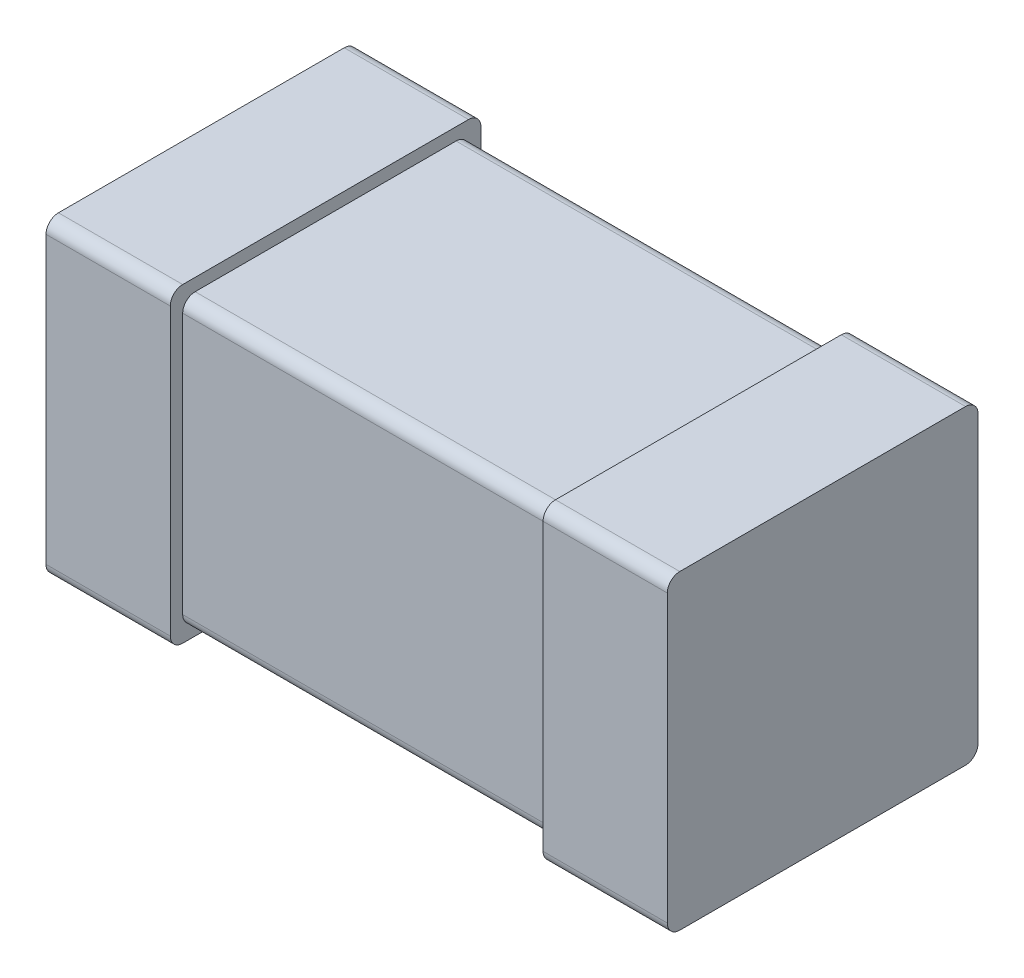
ISO-10303-21;
HEADER;
FILE_DESCRIPTION(('STEP AP214'),'2;1');
FILE_NAME('part.step','',(''),(''),'','','');
FILE_SCHEMA(('AUTOMOTIVE_DESIGN { 1 0 10303 214 1 1 1 1 }'));
ENDSEC;
DATA;
#1=APPLICATION_CONTEXT('core data for automotive mechanical design processes');
#2=APPLICATION_PROTOCOL_DEFINITION('international standard','automotive_design',2000,#1);
#3=PRODUCT_CONTEXT('',#1,'mechanical');
#4=PRODUCT('Part','Part','',(#3));
#5=PRODUCT_RELATED_PRODUCT_CATEGORY('part','',(#4));
#6=PRODUCT_DEFINITION_FORMATION('','',#4);
#7=PRODUCT_DEFINITION_CONTEXT('part definition',#1,'design');
#8=PRODUCT_DEFINITION('design','',#6,#7);
#9=PRODUCT_DEFINITION_SHAPE('','',#8);
#10=(LENGTH_UNIT() NAMED_UNIT(*) SI_UNIT(.MILLI.,.METRE.));
#11=(NAMED_UNIT(*) PLANE_ANGLE_UNIT() SI_UNIT($,.RADIAN.));
#12=(NAMED_UNIT(*) SI_UNIT($,.STERADIAN.) SOLID_ANGLE_UNIT());
#13=UNCERTAINTY_MEASURE_WITH_UNIT(LENGTH_MEASURE(1.E-05),#10,'distance_accuracy_value','');
#14=(GEOMETRIC_REPRESENTATION_CONTEXT(3) GLOBAL_UNCERTAINTY_ASSIGNED_CONTEXT((#13)) GLOBAL_UNIT_ASSIGNED_CONTEXT((#10,
#11,#12)) REPRESENTATION_CONTEXT('',''));
#15=CARTESIAN_POINT('',(0.,0.,0.));
#16=DIRECTION('',(0.,0.,1.));
#17=DIRECTION('',(1.,0.,0.));
#18=AXIS2_PLACEMENT_3D('',#15,#16,#17);
#19=CARTESIAN_POINT('',(0.5,-0.25,0.));
#20=DIRECTION('',(1.,0.,0.));
#21=DIRECTION('',(0.,1.,0.));
#22=AXIS2_PLACEMENT_3D('',#19,#20,#21);
#23=PLANE('',#22);
#24=DIRECTION('',(0.,0.,1.));
#25=VECTOR('',#24,1.);
#26=CARTESIAN_POINT('',(0.5,-0.25,0.));
#27=LINE('',#26,#25);
#28=CARTESIAN_POINT('',(0.5,-0.25,0.02));
#29=VERTEX_POINT('',#28);
#30=CARTESIAN_POINT('',(0.5,-0.25,0.48));
#31=VERTEX_POINT('',#30);
#32=EDGE_CURVE('E246',#29,#31,#27,.T.);
#33=ORIENTED_EDGE('',*,*,#32,.F.);
#34=CARTESIAN_POINT('',(0.5,-0.23,0.02));
#35=DIRECTION('',(1.,0.,0.));
#36=DIRECTION('',(0.,0.,1.));
#37=AXIS2_PLACEMENT_3D('',#34,#35,#36);
#38=CIRCLE('',#37,0.02);
#39=CARTESIAN_POINT('',(0.5,-0.23,0.));
#40=VERTEX_POINT('',#39);
#41=EDGE_CURVE('E237',#29,#40,#38,.T.);
#42=ORIENTED_EDGE('',*,*,#41,.T.);
#43=DIRECTION('',(0.,1.,0.));
#44=VECTOR('',#43,1.);
#45=CARTESIAN_POINT('',(0.5,-0.25,0.));
#46=LINE('',#45,#44);
#47=CARTESIAN_POINT('',(0.5,0.23,0.));
#48=VERTEX_POINT('',#47);
#49=EDGE_CURVE('E224',#40,#48,#46,.T.);
#50=ORIENTED_EDGE('',*,*,#49,.T.);
#51=CARTESIAN_POINT('',(0.5,0.23,0.02));
#52=DIRECTION('',(-1.,0.,0.));
#53=DIRECTION('',(0.,0.,1.));
#54=AXIS2_PLACEMENT_3D('',#51,#52,#53);
#55=CIRCLE('',#54,0.02);
#56=CARTESIAN_POINT('',(0.5,0.25,0.02));
#57=VERTEX_POINT('',#56);
#58=EDGE_CURVE('E21',#57,#48,#55,.T.);
#59=ORIENTED_EDGE('',*,*,#58,.F.);
#60=DIRECTION('',(0.,0.,1.));
#61=VECTOR('',#60,1.);
#62=CARTESIAN_POINT('',(0.5,0.25,0.));
#63=LINE('',#62,#61);
#64=CARTESIAN_POINT('',(0.5,0.25,0.48));
#65=VERTEX_POINT('',#64);
#66=EDGE_CURVE('E11',#57,#65,#63,.T.);
#67=ORIENTED_EDGE('',*,*,#66,.T.);
#68=CARTESIAN_POINT('',(0.5,0.23,0.48));
#69=DIRECTION('',(1.,0.,0.));
#70=DIRECTION('',(0.,0.,1.));
#71=AXIS2_PLACEMENT_3D('',#68,#69,#70);
#72=CIRCLE('',#71,0.02);
#73=CARTESIAN_POINT('',(0.5,0.23,0.5));
#74=VERTEX_POINT('',#73);
#75=EDGE_CURVE('E200',#65,#74,#72,.T.);
#76=ORIENTED_EDGE('',*,*,#75,.T.);
#77=DIRECTION('',(0.,1.,0.));
#78=VECTOR('',#77,1.);
#79=CARTESIAN_POINT('',(0.5,-0.25,0.5));
#80=LINE('',#79,#78);
#81=CARTESIAN_POINT('',(0.5,-0.23,0.5));
#82=VERTEX_POINT('',#81);
#83=EDGE_CURVE('E204',#82,#74,#80,.T.);
#84=ORIENTED_EDGE('',*,*,#83,.F.);
#85=CARTESIAN_POINT('',(0.5,-0.23,0.48));
#86=DIRECTION('',(-1.,0.,0.));
#87=DIRECTION('',(0.,0.,1.));
#88=AXIS2_PLACEMENT_3D('',#85,#86,#87);
#89=CIRCLE('',#88,0.02);
#90=EDGE_CURVE('E235',#31,#82,#89,.T.);
#91=ORIENTED_EDGE('',*,*,#90,.F.);
#92=EDGE_LOOP('',(#33,#42,#50,#59,#67,#76,#84,#91));
#93=FACE_BOUND('',#92,.T.);
#94=ADVANCED_FACE('F17',(#93),#23,.T.);
#95=CARTESIAN_POINT('',(0.3,0.25,0.));
#96=DIRECTION('',(0.,1.,0.));
#97=DIRECTION('',(1.,0.,0.));
#98=AXIS2_PLACEMENT_3D('',#95,#96,#97);
#99=PLANE('',#98);
#100=ORIENTED_EDGE('',*,*,#66,.F.);
#101=DIRECTION('',(1.,0.,0.));
#102=VECTOR('',#101,1.);
#103=CARTESIAN_POINT('',(0.3,0.25,0.02));
#104=LINE('',#103,#102);
#105=CARTESIAN_POINT('',(0.3,0.25,0.02));
#106=VERTEX_POINT('',#105);
#107=EDGE_CURVE('E219',#106,#57,#104,.T.);
#108=ORIENTED_EDGE('',*,*,#107,.F.);
#109=DIRECTION('',(0.,0.,1.));
#110=VECTOR('',#109,1.);
#111=CARTESIAN_POINT('',(0.3,0.25,0.));
#112=LINE('',#111,#110);
#113=CARTESIAN_POINT('',(0.3,0.25,0.48));
#114=VERTEX_POINT('',#113);
#115=EDGE_CURVE('E265',#106,#114,#112,.T.);
#116=ORIENTED_EDGE('',*,*,#115,.T.);
#117=DIRECTION('',(1.,0.,0.));
#118=VECTOR('',#117,1.);
#119=CARTESIAN_POINT('',(0.3,0.25,0.48));
#120=LINE('',#119,#118);
#121=EDGE_CURVE('E28',#114,#65,#120,.T.);
#122=ORIENTED_EDGE('',*,*,#121,.T.);
#123=EDGE_LOOP('',(#100,#108,#116,#122));
#124=FACE_BOUND('',#123,.T.);
#125=ADVANCED_FACE('F19',(#124),#99,.T.);
#126=CARTESIAN_POINT('',(0.3,0.23,0.48));
#127=DIRECTION('',(1.,0.,0.));
#128=DIRECTION('',(0.,1.,0.));
#129=AXIS2_PLACEMENT_3D('',#126,#127,#128);
#130=CYLINDRICAL_SURFACE('',#129,0.02);
#131=CARTESIAN_POINT('',(0.3,0.23,0.48));
#132=DIRECTION('',(1.,0.,0.));
#133=DIRECTION('',(0.,0.,1.));
#134=AXIS2_PLACEMENT_3D('',#131,#132,#133);
#135=CIRCLE('',#134,0.02);
#136=CARTESIAN_POINT('',(0.3,0.23,0.5));
#137=VERTEX_POINT('',#136);
#138=EDGE_CURVE('E214',#114,#137,#135,.T.);
#139=ORIENTED_EDGE('',*,*,#138,.T.);
#140=DIRECTION('',(1.,0.,0.));
#141=VECTOR('',#140,1.);
#142=CARTESIAN_POINT('',(0.3,0.23,0.5));
#143=LINE('',#142,#141);
#144=EDGE_CURVE('E211',#137,#74,#143,.T.);
#145=ORIENTED_EDGE('',*,*,#144,.T.);
#146=ORIENTED_EDGE('',*,*,#75,.F.);
#147=ORIENTED_EDGE('',*,*,#121,.F.);
#148=EDGE_LOOP('',(#139,#145,#146,#147));
#149=FACE_BOUND('',#148,.T.);
#150=ADVANCED_FACE('F212',(#149),#130,.T.);
#151=CARTESIAN_POINT('',(0.3,0.23,0.02));
#152=DIRECTION('',(1.,0.,0.));
#153=DIRECTION('',(0.,1.,0.));
#154=AXIS2_PLACEMENT_3D('',#151,#152,#153);
#155=CYLINDRICAL_SURFACE('',#154,0.02);
#156=ORIENTED_EDGE('',*,*,#107,.T.);
#157=ORIENTED_EDGE('',*,*,#58,.T.);
#158=DIRECTION('',(1.,0.,0.));
#159=VECTOR('',#158,1.);
#160=CARTESIAN_POINT('',(0.3,0.23,0.));
#161=LINE('',#160,#159);
#162=CARTESIAN_POINT('',(0.3,0.23,0.));
#163=VERTEX_POINT('',#162);
#164=EDGE_CURVE('E229',#163,#48,#161,.T.);
#165=ORIENTED_EDGE('',*,*,#164,.F.);
#166=CARTESIAN_POINT('',(0.3,0.23,0.02));
#167=DIRECTION('',(-1.,0.,0.));
#168=DIRECTION('',(0.,0.,1.));
#169=AXIS2_PLACEMENT_3D('',#166,#167,#168);
#170=CIRCLE('',#169,0.02);
#171=EDGE_CURVE('E260',#106,#163,#170,.T.);
#172=ORIENTED_EDGE('',*,*,#171,.F.);
#173=EDGE_LOOP('',(#156,#157,#165,#172));
#174=FACE_BOUND('',#173,.T.);
#175=ADVANCED_FACE('F586',(#174),#155,.T.);
#176=CARTESIAN_POINT('',(0.3,-0.25,0.5));
#177=DIRECTION('',(0.,0.,1.));
#178=DIRECTION('',(1.,0.,0.));
#179=AXIS2_PLACEMENT_3D('',#176,#177,#178);
#180=PLANE('',#179);
#181=DIRECTION('',(0.,1.,0.));
#182=VECTOR('',#181,1.);
#183=CARTESIAN_POINT('',(0.3,-0.25,0.5));
#184=LINE('',#183,#182);
#185=CARTESIAN_POINT('',(0.3,-0.23,0.5));
#186=VERTEX_POINT('',#185);
#187=EDGE_CURVE('E268',#186,#137,#184,.T.);
#188=ORIENTED_EDGE('',*,*,#187,.F.);
#189=DIRECTION('',(1.,0.,0.));
#190=VECTOR('',#189,1.);
#191=CARTESIAN_POINT('',(0.3,-0.23,0.5));
#192=LINE('',#191,#190);
#193=EDGE_CURVE('E221',#186,#82,#192,.T.);
#194=ORIENTED_EDGE('',*,*,#193,.T.);
#195=ORIENTED_EDGE('',*,*,#83,.T.);
#196=ORIENTED_EDGE('',*,*,#144,.F.);
#197=EDGE_LOOP('',(#188,#194,#195,#196));
#198=FACE_BOUND('',#197,.T.);
#199=ADVANCED_FACE('F220',(#198),#180,.T.);
#200=CARTESIAN_POINT('',(0.3,-0.25,0.));
#201=DIRECTION('',(0.,0.,1.));
#202=DIRECTION('',(1.,0.,0.));
#203=AXIS2_PLACEMENT_3D('',#200,#201,#202);
#204=PLANE('',#203);
#205=ORIENTED_EDGE('',*,*,#164,.T.);
#206=ORIENTED_EDGE('',*,*,#49,.F.);
#207=DIRECTION('',(1.,0.,0.));
#208=VECTOR('',#207,1.);
#209=CARTESIAN_POINT('',(0.3,-0.23,0.));
#210=LINE('',#209,#208);
#211=CARTESIAN_POINT('',(0.3,-0.23,0.));
#212=VERTEX_POINT('',#211);
#213=EDGE_CURVE('E242',#212,#40,#210,.T.);
#214=ORIENTED_EDGE('',*,*,#213,.F.);
#215=DIRECTION('',(0.,1.,0.));
#216=VECTOR('',#215,1.);
#217=CARTESIAN_POINT('',(0.3,-0.25,0.));
#218=LINE('',#217,#216);
#219=EDGE_CURVE('E264',#212,#163,#218,.T.);
#220=ORIENTED_EDGE('',*,*,#219,.T.);
#221=EDGE_LOOP('',(#205,#206,#214,#220));
#222=FACE_BOUND('',#221,.T.);
#223=ADVANCED_FACE('F537',(#222),#204,.F.);
#224=CARTESIAN_POINT('',(0.3,-0.23,0.48));
#225=DIRECTION('',(1.,0.,0.));
#226=DIRECTION('',(0.,-1.,0.));
#227=AXIS2_PLACEMENT_3D('',#224,#225,#226);
#228=CYLINDRICAL_SURFACE('',#227,0.02);
#229=DIRECTION('',(1.,0.,0.));
#230=VECTOR('',#229,1.);
#231=CARTESIAN_POINT('',(0.3,-0.25,0.48));
#232=LINE('',#231,#230);
#233=CARTESIAN_POINT('',(0.3,-0.25,0.48));
#234=VERTEX_POINT('',#233);
#235=EDGE_CURVE('E251',#234,#31,#232,.T.);
#236=ORIENTED_EDGE('',*,*,#235,.T.);
#237=ORIENTED_EDGE('',*,*,#90,.T.);
#238=ORIENTED_EDGE('',*,*,#193,.F.);
#239=CARTESIAN_POINT('',(0.3,-0.23,0.48));
#240=DIRECTION('',(-1.,0.,0.));
#241=DIRECTION('',(0.,0.,1.));
#242=AXIS2_PLACEMENT_3D('',#239,#240,#241);
#243=CIRCLE('',#242,0.02);
#244=EDGE_CURVE('E269',#234,#186,#243,.T.);
#245=ORIENTED_EDGE('',*,*,#244,.F.);
#246=EDGE_LOOP('',(#236,#237,#238,#245));
#247=FACE_BOUND('',#246,.T.);
#248=ADVANCED_FACE('F533',(#247),#228,.T.);
#249=CARTESIAN_POINT('',(0.3,-0.23,0.02));
#250=DIRECTION('',(1.,0.,0.));
#251=DIRECTION('',(0.,-1.,0.));
#252=AXIS2_PLACEMENT_3D('',#249,#250,#251);
#253=CYLINDRICAL_SURFACE('',#252,0.02);
#254=CARTESIAN_POINT('',(0.3,-0.23,0.02));
#255=DIRECTION('',(1.,0.,0.));
#256=DIRECTION('',(0.,0.,1.));
#257=AXIS2_PLACEMENT_3D('',#254,#255,#256);
#258=CIRCLE('',#257,0.02);
#259=CARTESIAN_POINT('',(0.3,-0.25,0.02));
#260=VERTEX_POINT('',#259);
#261=EDGE_CURVE('E259',#260,#212,#258,.T.);
#262=ORIENTED_EDGE('',*,*,#261,.T.);
#263=ORIENTED_EDGE('',*,*,#213,.T.);
#264=ORIENTED_EDGE('',*,*,#41,.F.);
#265=DIRECTION('',(1.,0.,0.));
#266=VECTOR('',#265,1.);
#267=CARTESIAN_POINT('',(0.3,-0.25,0.02));
#268=LINE('',#267,#266);
#269=EDGE_CURVE('E250',#260,#29,#268,.T.);
#270=ORIENTED_EDGE('',*,*,#269,.F.);
#271=EDGE_LOOP('',(#262,#263,#264,#270));
#272=FACE_BOUND('',#271,.T.);
#273=ADVANCED_FACE('F536',(#272),#253,.T.);
#274=CARTESIAN_POINT('',(0.3,-0.25,0.));
#275=DIRECTION('',(0.,1.,0.));
#276=DIRECTION('',(1.,0.,0.));
#277=AXIS2_PLACEMENT_3D('',#274,#275,#276);
#278=PLANE('',#277);
#279=ORIENTED_EDGE('',*,*,#235,.F.);
#280=DIRECTION('',(0.,0.,1.));
#281=VECTOR('',#280,1.);
#282=CARTESIAN_POINT('',(0.3,-0.25,0.));
#283=LINE('',#282,#281);
#284=EDGE_CURVE('E255',#260,#234,#283,.T.);
#285=ORIENTED_EDGE('',*,*,#284,.F.);
#286=ORIENTED_EDGE('',*,*,#269,.T.);
#287=ORIENTED_EDGE('',*,*,#32,.T.);
#288=EDGE_LOOP('',(#279,#285,#286,#287));
#289=FACE_BOUND('',#288,.T.);
#290=ADVANCED_FACE('F521',(#289),#278,.F.);
#291=CARTESIAN_POINT('',(0.3,-0.25,0.));
#292=DIRECTION('',(1.,0.,0.));
#293=DIRECTION('',(0.,1.,0.));
#294=AXIS2_PLACEMENT_3D('',#291,#292,#293);
#295=PLANE('',#294);
#296=DIRECTION('',(0.,1.,0.));
#297=VECTOR('',#296,1.);
#298=CARTESIAN_POINT('',(0.3,-0.23,0.02));
#299=LINE('',#298,#297);
#300=CARTESIAN_POINT('',(0.3,-0.21,0.02));
#301=VERTEX_POINT('',#300);
#302=CARTESIAN_POINT('',(0.3,0.21,0.02));
#303=VERTEX_POINT('',#302);
#304=EDGE_CURVE('E311',#301,#303,#299,.T.);
#305=ORIENTED_EDGE('',*,*,#304,.T.);
#306=CARTESIAN_POINT('',(0.3,0.21,0.04));
#307=DIRECTION('',(-1.,0.,0.));
#308=DIRECTION('',(0.,0.,1.));
#309=AXIS2_PLACEMENT_3D('',#306,#307,#308);
#310=CIRCLE('',#309,0.02);
#311=CARTESIAN_POINT('',(0.3,0.23,0.04));
#312=VERTEX_POINT('',#311);
#313=EDGE_CURVE('E306',#312,#303,#310,.T.);
#314=ORIENTED_EDGE('',*,*,#313,.F.);
#315=DIRECTION('',(0.,0.,1.));
#316=VECTOR('',#315,1.);
#317=CARTESIAN_POINT('',(0.3,0.23,0.02));
#318=LINE('',#317,#316);
#319=CARTESIAN_POINT('',(0.3,0.23,0.46));
#320=VERTEX_POINT('',#319);
#321=EDGE_CURVE('E302',#312,#320,#318,.T.);
#322=ORIENTED_EDGE('',*,*,#321,.T.);
#323=CARTESIAN_POINT('',(0.3,0.21,0.46));
#324=DIRECTION('',(1.,0.,0.));
#325=DIRECTION('',(0.,0.,1.));
#326=AXIS2_PLACEMENT_3D('',#323,#324,#325);
#327=CIRCLE('',#326,0.02);
#328=CARTESIAN_POINT('',(0.3,0.21,0.48));
#329=VERTEX_POINT('',#328);
#330=EDGE_CURVE('E293',#320,#329,#327,.T.);
#331=ORIENTED_EDGE('',*,*,#330,.T.);
#332=DIRECTION('',(0.,1.,0.));
#333=VECTOR('',#332,1.);
#334=CARTESIAN_POINT('',(0.3,-0.23,0.48));
#335=LINE('',#334,#333);
#336=CARTESIAN_POINT('',(0.3,-0.21,0.48));
#337=VERTEX_POINT('',#336);
#338=EDGE_CURVE('E286',#337,#329,#335,.T.);
#339=ORIENTED_EDGE('',*,*,#338,.F.);
#340=CARTESIAN_POINT('',(0.3,-0.21,0.46));
#341=DIRECTION('',(-1.,0.,0.));
#342=DIRECTION('',(0.,0.,1.));
#343=AXIS2_PLACEMENT_3D('',#340,#341,#342);
#344=CIRCLE('',#343,0.02);
#345=CARTESIAN_POINT('',(0.3,-0.23,0.46));
#346=VERTEX_POINT('',#345);
#347=EDGE_CURVE('E276',#346,#337,#344,.T.);
#348=ORIENTED_EDGE('',*,*,#347,.F.);
#349=DIRECTION('',(0.,0.,1.));
#350=VECTOR('',#349,1.);
#351=CARTESIAN_POINT('',(0.3,-0.23,0.02));
#352=LINE('',#351,#350);
#353=CARTESIAN_POINT('',(0.3,-0.23,0.04));
#354=VERTEX_POINT('',#353);
#355=EDGE_CURVE('E273',#354,#346,#352,.T.);
#356=ORIENTED_EDGE('',*,*,#355,.F.);
#357=CARTESIAN_POINT('',(0.3,-0.21,0.04));
#358=DIRECTION('',(1.,0.,0.));
#359=DIRECTION('',(0.,0.,1.));
#360=AXIS2_PLACEMENT_3D('',#357,#358,#359);
#361=CIRCLE('',#360,0.02);
#362=EDGE_CURVE('E317',#354,#301,#361,.T.);
#363=ORIENTED_EDGE('',*,*,#362,.T.);
#364=EDGE_LOOP('',(#305,#314,#322,#331,#339,#348,#356,#363));
#365=FACE_BOUND('',#364,.T.);
#366=ORIENTED_EDGE('',*,*,#244,.T.);
#367=ORIENTED_EDGE('',*,*,#187,.T.);
#368=ORIENTED_EDGE('',*,*,#138,.F.);
#369=ORIENTED_EDGE('',*,*,#115,.F.);
#370=ORIENTED_EDGE('',*,*,#171,.T.);
#371=ORIENTED_EDGE('',*,*,#219,.F.);
#372=ORIENTED_EDGE('',*,*,#261,.F.);
#373=ORIENTED_EDGE('',*,*,#284,.T.);
#374=EDGE_LOOP('',(#366,#367,#368,#369,#370,#371,#372,#373));
#375=FACE_BOUND('',#374,.T.);
#376=ADVANCED_FACE('F481',(#365,#375),#295,.F.);
#377=CARTESIAN_POINT('',(-0.3,-0.23,0.02));
#378=DIRECTION('',(0.,1.,0.));
#379=DIRECTION('',(1.,0.,0.));
#380=AXIS2_PLACEMENT_3D('',#377,#378,#379);
#381=PLANE('',#380);
#382=DIRECTION('',(1.,0.,0.));
#383=VECTOR('',#382,1.);
#384=CARTESIAN_POINT('',(-0.3,-0.23,0.46));
#385=LINE('',#384,#383);
#386=CARTESIAN_POINT('',(-0.3,-0.23,0.46));
#387=VERTEX_POINT('',#386);
#388=EDGE_CURVE('E279',#387,#346,#385,.T.);
#389=ORIENTED_EDGE('',*,*,#388,.F.);
#390=DIRECTION('',(0.,0.,1.));
#391=VECTOR('',#390,1.);
#392=CARTESIAN_POINT('',(-0.3,-0.23,0.02));
#393=LINE('',#392,#391);
#394=CARTESIAN_POINT('',(-0.3,-0.23,0.04));
#395=VERTEX_POINT('',#394);
#396=EDGE_CURVE('E352',#395,#387,#393,.T.);
#397=ORIENTED_EDGE('',*,*,#396,.F.);
#398=DIRECTION('',(1.,0.,0.));
#399=VECTOR('',#398,1.);
#400=CARTESIAN_POINT('',(-0.3,-0.23,0.04));
#401=LINE('',#400,#399);
#402=EDGE_CURVE('E312',#395,#354,#401,.T.);
#403=ORIENTED_EDGE('',*,*,#402,.T.);
#404=ORIENTED_EDGE('',*,*,#355,.T.);
#405=EDGE_LOOP('',(#389,#397,#403,#404));
#406=FACE_BOUND('',#405,.T.);
#407=ADVANCED_FACE('F512',(#406),#381,.F.);
#408=CARTESIAN_POINT('',(-0.3,-0.21,0.46));
#409=DIRECTION('',(1.,0.,0.));
#410=DIRECTION('',(0.,-1.,0.));
#411=AXIS2_PLACEMENT_3D('',#408,#409,#410);
#412=CYLINDRICAL_SURFACE('',#411,0.02);
#413=ORIENTED_EDGE('',*,*,#388,.T.);
#414=ORIENTED_EDGE('',*,*,#347,.T.);
#415=DIRECTION('',(1.,0.,0.));
#416=VECTOR('',#415,1.);
#417=CARTESIAN_POINT('',(-0.3,-0.21,0.48));
#418=LINE('',#417,#416);
#419=CARTESIAN_POINT('',(-0.3,-0.21,0.48));
#420=VERTEX_POINT('',#419);
#421=EDGE_CURVE('E289',#420,#337,#418,.T.);
#422=ORIENTED_EDGE('',*,*,#421,.F.);
#423=CARTESIAN_POINT('',(-0.3,-0.21,0.46));
#424=DIRECTION('',(-1.,0.,0.));
#425=DIRECTION('',(0.,0.,1.));
#426=AXIS2_PLACEMENT_3D('',#423,#424,#425);
#427=CIRCLE('',#426,0.02);
#428=EDGE_CURVE('E348',#387,#420,#427,.T.);
#429=ORIENTED_EDGE('',*,*,#428,.F.);
#430=EDGE_LOOP('',(#413,#414,#422,#429));
#431=FACE_BOUND('',#430,.T.);
#432=ADVANCED_FACE('F509',(#431),#412,.T.);
#433=CARTESIAN_POINT('',(-0.3,-0.23,0.48));
#434=DIRECTION('',(0.,0.,1.));
#435=DIRECTION('',(1.,0.,0.));
#436=AXIS2_PLACEMENT_3D('',#433,#434,#435);
#437=PLANE('',#436);
#438=DIRECTION('',(0.,1.,0.));
#439=VECTOR('',#438,1.);
#440=CARTESIAN_POINT('',(-0.3,-0.23,0.48));
#441=LINE('',#440,#439);
#442=CARTESIAN_POINT('',(-0.3,0.21,0.48));
#443=VERTEX_POINT('',#442);
#444=EDGE_CURVE('E344',#420,#443,#441,.T.);
#445=ORIENTED_EDGE('',*,*,#444,.F.);
#446=ORIENTED_EDGE('',*,*,#421,.T.);
#447=ORIENTED_EDGE('',*,*,#338,.T.);
#448=DIRECTION('',(1.,0.,0.));
#449=VECTOR('',#448,1.);
#450=CARTESIAN_POINT('',(-0.3,0.21,0.48));
#451=LINE('',#450,#449);
#452=EDGE_CURVE('E294',#443,#329,#451,.T.);
#453=ORIENTED_EDGE('',*,*,#452,.F.);
#454=EDGE_LOOP('',(#445,#446,#447,#453));
#455=FACE_BOUND('',#454,.T.);
#456=ADVANCED_FACE('F506',(#455),#437,.T.);
#457=CARTESIAN_POINT('',(-0.3,0.21,0.46));
#458=DIRECTION('',(1.,0.,0.));
#459=DIRECTION('',(0.,1.,0.));
#460=AXIS2_PLACEMENT_3D('',#457,#458,#459);
#461=CYLINDRICAL_SURFACE('',#460,0.02);
#462=CARTESIAN_POINT('',(-0.3,0.21,0.46));
#463=DIRECTION('',(1.,0.,0.));
#464=DIRECTION('',(0.,0.,1.));
#465=AXIS2_PLACEMENT_3D('',#462,#463,#464);
#466=CIRCLE('',#465,0.02);
#467=CARTESIAN_POINT('',(-0.3,0.23,0.46));
#468=VERTEX_POINT('',#467);
#469=EDGE_CURVE('E340',#468,#443,#466,.T.);
#470=ORIENTED_EDGE('',*,*,#469,.T.);
#471=ORIENTED_EDGE('',*,*,#452,.T.);
#472=ORIENTED_EDGE('',*,*,#330,.F.);
#473=DIRECTION('',(1.,0.,0.));
#474=VECTOR('',#473,1.);
#475=CARTESIAN_POINT('',(-0.3,0.23,0.46));
#476=LINE('',#475,#474);
#477=EDGE_CURVE('E298',#468,#320,#476,.T.);
#478=ORIENTED_EDGE('',*,*,#477,.F.);
#479=EDGE_LOOP('',(#470,#471,#472,#478));
#480=FACE_BOUND('',#479,.T.);
#481=ADVANCED_FACE('F503',(#480),#461,.T.);
#482=CARTESIAN_POINT('',(-0.3,0.23,0.02));
#483=DIRECTION('',(0.,1.,0.));
#484=DIRECTION('',(1.,0.,0.));
#485=AXIS2_PLACEMENT_3D('',#482,#483,#484);
#486=PLANE('',#485);
#487=ORIENTED_EDGE('',*,*,#321,.F.);
#488=DIRECTION('',(1.,0.,0.));
#489=VECTOR('',#488,1.);
#490=CARTESIAN_POINT('',(-0.3,0.23,0.04));
#491=LINE('',#490,#489);
#492=CARTESIAN_POINT('',(-0.3,0.23,0.04));
#493=VERTEX_POINT('',#492);
#494=EDGE_CURVE('E307',#493,#312,#491,.T.);
#495=ORIENTED_EDGE('',*,*,#494,.F.);
#496=DIRECTION('',(0.,0.,1.));
#497=VECTOR('',#496,1.);
#498=CARTESIAN_POINT('',(-0.3,0.23,0.02));
#499=LINE('',#498,#497);
#500=EDGE_CURVE('E333',#493,#468,#499,.T.);
#501=ORIENTED_EDGE('',*,*,#500,.T.);
#502=ORIENTED_EDGE('',*,*,#477,.T.);
#503=EDGE_LOOP('',(#487,#495,#501,#502));
#504=FACE_BOUND('',#503,.T.);
#505=ADVANCED_FACE('F501',(#504),#486,.T.);
#506=CARTESIAN_POINT('',(-0.3,0.21,0.04));
#507=DIRECTION('',(1.,0.,0.));
#508=DIRECTION('',(0.,1.,0.));
#509=AXIS2_PLACEMENT_3D('',#506,#507,#508);
#510=CYLINDRICAL_SURFACE('',#509,0.02);
#511=ORIENTED_EDGE('',*,*,#494,.T.);
#512=ORIENTED_EDGE('',*,*,#313,.T.);
#513=DIRECTION('',(1.,0.,0.));
#514=VECTOR('',#513,1.);
#515=CARTESIAN_POINT('',(-0.3,0.21,0.02));
#516=LINE('',#515,#514);
#517=CARTESIAN_POINT('',(-0.3,0.21,0.02));
#518=VERTEX_POINT('',#517);
#519=EDGE_CURVE('E316',#518,#303,#516,.T.);
#520=ORIENTED_EDGE('',*,*,#519,.F.);
#521=CARTESIAN_POINT('',(-0.3,0.21,0.04));
#522=DIRECTION('',(-1.,0.,0.));
#523=DIRECTION('',(0.,0.,1.));
#524=AXIS2_PLACEMENT_3D('',#521,#522,#523);
#525=CIRCLE('',#524,0.02);
#526=EDGE_CURVE('E326',#493,#518,#525,.T.);
#527=ORIENTED_EDGE('',*,*,#526,.F.);
#528=EDGE_LOOP('',(#511,#512,#520,#527));
#529=FACE_BOUND('',#528,.T.);
#530=ADVANCED_FACE('F498',(#529),#510,.T.);
#531=CARTESIAN_POINT('',(-0.3,-0.23,0.02));
#532=DIRECTION('',(0.,0.,1.));
#533=DIRECTION('',(1.,0.,0.));
#534=AXIS2_PLACEMENT_3D('',#531,#532,#533);
#535=PLANE('',#534);
#536=ORIENTED_EDGE('',*,*,#519,.T.);
#537=ORIENTED_EDGE('',*,*,#304,.F.);
#538=DIRECTION('',(1.,0.,0.));
#539=VECTOR('',#538,1.);
#540=CARTESIAN_POINT('',(-0.3,-0.21,0.02));
#541=LINE('',#540,#539);
#542=CARTESIAN_POINT('',(-0.3,-0.21,0.02));
#543=VERTEX_POINT('',#542);
#544=EDGE_CURVE('E318',#543,#301,#541,.T.);
#545=ORIENTED_EDGE('',*,*,#544,.F.);
#546=DIRECTION('',(0.,1.,0.));
#547=VECTOR('',#546,1.);
#548=CARTESIAN_POINT('',(-0.3,-0.23,0.02));
#549=LINE('',#548,#547);
#550=EDGE_CURVE('E322',#543,#518,#549,.T.);
#551=ORIENTED_EDGE('',*,*,#550,.T.);
#552=EDGE_LOOP('',(#536,#537,#545,#551));
#553=FACE_BOUND('',#552,.T.);
#554=ADVANCED_FACE('F490',(#553),#535,.F.);
#555=CARTESIAN_POINT('',(-0.3,-0.21,0.04));
#556=DIRECTION('',(1.,0.,0.));
#557=DIRECTION('',(0.,-1.,0.));
#558=AXIS2_PLACEMENT_3D('',#555,#556,#557);
#559=CYLINDRICAL_SURFACE('',#558,0.02);
#560=CARTESIAN_POINT('',(-0.3,-0.21,0.04));
#561=DIRECTION('',(1.,0.,0.));
#562=DIRECTION('',(0.,0.,1.));
#563=AXIS2_PLACEMENT_3D('',#560,#561,#562);
#564=CIRCLE('',#563,0.02);
#565=EDGE_CURVE('E356',#395,#543,#564,.T.);
#566=ORIENTED_EDGE('',*,*,#565,.T.);
#567=ORIENTED_EDGE('',*,*,#544,.T.);
#568=ORIENTED_EDGE('',*,*,#362,.F.);
#569=ORIENTED_EDGE('',*,*,#402,.F.);
#570=EDGE_LOOP('',(#566,#567,#568,#569));
#571=FACE_BOUND('',#570,.T.);
#572=ADVANCED_FACE('F486',(#571),#559,.T.);
#573=CARTESIAN_POINT('',(-0.3,-0.25,0.));
#574=DIRECTION('',(1.,0.,0.));
#575=DIRECTION('',(0.,1.,0.));
#576=AXIS2_PLACEMENT_3D('',#573,#574,#575);
#577=PLANE('',#576);
#578=ORIENTED_EDGE('',*,*,#565,.F.);
#579=ORIENTED_EDGE('',*,*,#396,.T.);
#580=ORIENTED_EDGE('',*,*,#428,.T.);
#581=ORIENTED_EDGE('',*,*,#444,.T.);
#582=ORIENTED_EDGE('',*,*,#469,.F.);
#583=ORIENTED_EDGE('',*,*,#500,.F.);
#584=ORIENTED_EDGE('',*,*,#526,.T.);
#585=ORIENTED_EDGE('',*,*,#550,.F.);
#586=EDGE_LOOP('',(#578,#579,#580,#581,#582,#583,#584,#585));
#587=FACE_BOUND('',#586,.T.);
#588=DIRECTION('',(0.,0.,1.));
#589=VECTOR('',#588,1.);
#590=CARTESIAN_POINT('',(-0.3,-0.25,0.));
#591=LINE('',#590,#589);
#592=CARTESIAN_POINT('',(-0.3,-0.25,0.02));
#593=VERTEX_POINT('',#592);
#594=CARTESIAN_POINT('',(-0.3,-0.25,0.48));
#595=VERTEX_POINT('',#594);
#596=EDGE_CURVE('E415',#593,#595,#591,.T.);
#597=ORIENTED_EDGE('',*,*,#596,.F.);
#598=CARTESIAN_POINT('',(-0.3,-0.23,0.02));
#599=DIRECTION('',(1.,0.,0.));
#600=DIRECTION('',(0.,0.,1.));
#601=AXIS2_PLACEMENT_3D('',#598,#599,#600);
#602=CIRCLE('',#601,0.02);
#603=CARTESIAN_POINT('',(-0.3,-0.23,0.));
#604=VERTEX_POINT('',#603);
#605=EDGE_CURVE('E410',#593,#604,#602,.T.);
#606=ORIENTED_EDGE('',*,*,#605,.T.);
#607=DIRECTION('',(0.,1.,0.));
#608=VECTOR('',#607,1.);
#609=CARTESIAN_POINT('',(-0.3,-0.25,0.));
#610=LINE('',#609,#608);
#611=CARTESIAN_POINT('',(-0.3,0.23,0.));
#612=VERTEX_POINT('',#611);
#613=EDGE_CURVE('E392',#604,#612,#610,.T.);
#614=ORIENTED_EDGE('',*,*,#613,.T.);
#615=CARTESIAN_POINT('',(-0.3,0.23,0.02));
#616=DIRECTION('',(-1.,0.,0.));
#617=DIRECTION('',(0.,0.,1.));
#618=AXIS2_PLACEMENT_3D('',#615,#616,#617);
#619=CIRCLE('',#618,0.02);
#620=CARTESIAN_POINT('',(-0.3,0.25,0.02));
#621=VERTEX_POINT('',#620);
#622=EDGE_CURVE('E375',#621,#612,#619,.T.);
#623=ORIENTED_EDGE('',*,*,#622,.F.);
#624=DIRECTION('',(0.,0.,1.));
#625=VECTOR('',#624,1.);
#626=CARTESIAN_POINT('',(-0.3,0.25,0.));
#627=LINE('',#626,#625);
#628=CARTESIAN_POINT('',(-0.3,0.25,0.48));
#629=VERTEX_POINT('',#628);
#630=EDGE_CURVE('E360',#621,#629,#627,.T.);
#631=ORIENTED_EDGE('',*,*,#630,.T.);
#632=CARTESIAN_POINT('',(-0.3,0.23,0.48));
#633=DIRECTION('',(1.,0.,0.));
#634=DIRECTION('',(0.,0.,1.));
#635=AXIS2_PLACEMENT_3D('',#632,#633,#634);
#636=CIRCLE('',#635,0.02);
#637=CARTESIAN_POINT('',(-0.3,0.23,0.5));
#638=VERTEX_POINT('',#637);
#639=EDGE_CURVE('E370',#629,#638,#636,.T.);
#640=ORIENTED_EDGE('',*,*,#639,.T.);
#641=DIRECTION('',(0.,1.,0.));
#642=VECTOR('',#641,1.);
#643=CARTESIAN_POINT('',(-0.3,-0.25,0.5));
#644=LINE('',#643,#642);
#645=CARTESIAN_POINT('',(-0.3,-0.23,0.5));
#646=VERTEX_POINT('',#645);
#647=EDGE_CURVE('E388',#646,#638,#644,.T.);
#648=ORIENTED_EDGE('',*,*,#647,.F.);
#649=CARTESIAN_POINT('',(-0.3,-0.23,0.48));
#650=DIRECTION('',(-1.,0.,0.));
#651=DIRECTION('',(0.,0.,1.));
#652=AXIS2_PLACEMENT_3D('',#649,#650,#651);
#653=CIRCLE('',#652,0.02);
#654=EDGE_CURVE('E409',#595,#646,#653,.T.);
#655=ORIENTED_EDGE('',*,*,#654,.F.);
#656=EDGE_LOOP('',(#597,#606,#614,#623,#631,#640,#648,#655));
#657=FACE_BOUND('',#656,.T.);
#658=ADVANCED_FACE('F492',(#587,#657),#577,.T.);
#659=CARTESIAN_POINT('',(-0.5,0.25,0.));
#660=DIRECTION('',(0.,1.,0.));
#661=DIRECTION('',(1.,0.,0.));
#662=AXIS2_PLACEMENT_3D('',#659,#660,#661);
#663=PLANE('',#662);
#664=ORIENTED_EDGE('',*,*,#630,.F.);
#665=DIRECTION('',(1.,0.,0.));
#666=VECTOR('',#665,1.);
#667=CARTESIAN_POINT('',(-0.5,0.25,0.02));
#668=LINE('',#667,#666);
#669=CARTESIAN_POINT('',(-0.5,0.25,0.02));
#670=VERTEX_POINT('',#669);
#671=EDGE_CURVE('E378',#670,#621,#668,.T.);
#672=ORIENTED_EDGE('',*,*,#671,.F.);
#673=DIRECTION('',(0.,0.,1.));
#674=VECTOR('',#673,1.);
#675=CARTESIAN_POINT('',(-0.5,0.25,0.));
#676=LINE('',#675,#674);
#677=CARTESIAN_POINT('',(-0.5,0.25,0.48));
#678=VERTEX_POINT('',#677);
#679=EDGE_CURVE('E451',#670,#678,#676,.T.);
#680=ORIENTED_EDGE('',*,*,#679,.T.);
#681=DIRECTION('',(1.,0.,0.));
#682=VECTOR('',#681,1.);
#683=CARTESIAN_POINT('',(-0.5,0.25,0.48));
#684=LINE('',#683,#682);
#685=EDGE_CURVE('E366',#678,#629,#684,.T.);
#686=ORIENTED_EDGE('',*,*,#685,.T.);
#687=EDGE_LOOP('',(#664,#672,#680,#686));
#688=FACE_BOUND('',#687,.T.);
#689=ADVANCED_FACE('F552',(#688),#663,.T.);
#690=CARTESIAN_POINT('',(-0.5,0.23,0.48));
#691=DIRECTION('',(1.,0.,0.));
#692=DIRECTION('',(0.,1.,0.));
#693=AXIS2_PLACEMENT_3D('',#690,#691,#692);
#694=CYLINDRICAL_SURFACE('',#693,0.02);
#695=CARTESIAN_POINT('',(-0.5,0.23,0.48));
#696=DIRECTION('',(1.,0.,0.));
#697=DIRECTION('',(0.,0.,1.));
#698=AXIS2_PLACEMENT_3D('',#695,#696,#697);
#699=CIRCLE('',#698,0.02);
#700=CARTESIAN_POINT('',(-0.5,0.23,0.5));
#701=VERTEX_POINT('',#700);
#702=EDGE_CURVE('E455',#678,#701,#699,.T.);
#703=ORIENTED_EDGE('',*,*,#702,.T.);
#704=DIRECTION('',(1.,0.,0.));
#705=VECTOR('',#704,1.);
#706=CARTESIAN_POINT('',(-0.5,0.23,0.5));
#707=LINE('',#706,#705);
#708=EDGE_CURVE('E382',#701,#638,#707,.T.);
#709=ORIENTED_EDGE('',*,*,#708,.T.);
#710=ORIENTED_EDGE('',*,*,#639,.F.);
#711=ORIENTED_EDGE('',*,*,#685,.F.);
#712=EDGE_LOOP('',(#703,#709,#710,#711));
#713=FACE_BOUND('',#712,.T.);
#714=ADVANCED_FACE('F579',(#713),#694,.T.);
#715=CARTESIAN_POINT('',(-0.5,0.23,0.02));
#716=DIRECTION('',(1.,0.,0.));
#717=DIRECTION('',(0.,1.,0.));
#718=AXIS2_PLACEMENT_3D('',#715,#716,#717);
#719=CYLINDRICAL_SURFACE('',#718,0.02);
#720=ORIENTED_EDGE('',*,*,#671,.T.);
#721=ORIENTED_EDGE('',*,*,#622,.T.);
#722=DIRECTION('',(1.,0.,0.));
#723=VECTOR('',#722,1.);
#724=CARTESIAN_POINT('',(-0.5,0.23,0.));
#725=LINE('',#724,#723);
#726=CARTESIAN_POINT('',(-0.5,0.23,0.));
#727=VERTEX_POINT('',#726);
#728=EDGE_CURVE('E399',#727,#612,#725,.T.);
#729=ORIENTED_EDGE('',*,*,#728,.F.);
#730=CARTESIAN_POINT('',(-0.5,0.23,0.02));
#731=DIRECTION('',(-1.,0.,0.));
#732=DIRECTION('',(0.,0.,1.));
#733=AXIS2_PLACEMENT_3D('',#730,#731,#732);
#734=CIRCLE('',#733,0.02);
#735=EDGE_CURVE('E447',#670,#727,#734,.T.);
#736=ORIENTED_EDGE('',*,*,#735,.F.);
#737=EDGE_LOOP('',(#720,#721,#729,#736));
#738=FACE_BOUND('',#737,.T.);
#739=ADVANCED_FACE('F573',(#738),#719,.T.);
#740=CARTESIAN_POINT('',(-0.5,-0.25,0.5));
#741=DIRECTION('',(0.,0.,1.));
#742=DIRECTION('',(1.,0.,0.));
#743=AXIS2_PLACEMENT_3D('',#740,#741,#742);
#744=PLANE('',#743);
#745=DIRECTION('',(0.,1.,0.));
#746=VECTOR('',#745,1.);
#747=CARTESIAN_POINT('',(-0.5,-0.25,0.5));
#748=LINE('',#747,#746);
#749=CARTESIAN_POINT('',(-0.5,-0.23,0.5));
#750=VERTEX_POINT('',#749);
#751=EDGE_CURVE('E459',#750,#701,#748,.T.);
#752=ORIENTED_EDGE('',*,*,#751,.F.);
#753=DIRECTION('',(1.,0.,0.));
#754=VECTOR('',#753,1.);
#755=CARTESIAN_POINT('',(-0.5,-0.23,0.5));
#756=LINE('',#755,#754);
#757=EDGE_CURVE('E403',#750,#646,#756,.T.);
#758=ORIENTED_EDGE('',*,*,#757,.T.);
#759=ORIENTED_EDGE('',*,*,#647,.T.);
#760=ORIENTED_EDGE('',*,*,#708,.F.);
#761=EDGE_LOOP('',(#752,#758,#759,#760));
#762=FACE_BOUND('',#761,.T.);
#763=ADVANCED_FACE('F563',(#762),#744,.T.);
#764=CARTESIAN_POINT('',(-0.5,-0.25,0.));
#765=DIRECTION('',(0.,0.,1.));
#766=DIRECTION('',(1.,0.,0.));
#767=AXIS2_PLACEMENT_3D('',#764,#765,#766);
#768=PLANE('',#767);
#769=ORIENTED_EDGE('',*,*,#728,.T.);
#770=ORIENTED_EDGE('',*,*,#613,.F.);
#771=DIRECTION('',(1.,0.,0.));
#772=VECTOR('',#771,1.);
#773=CARTESIAN_POINT('',(-0.5,-0.23,0.));
#774=LINE('',#773,#772);
#775=CARTESIAN_POINT('',(-0.5,-0.23,0.));
#776=VERTEX_POINT('',#775);
#777=EDGE_CURVE('E414',#776,#604,#774,.T.);
#778=ORIENTED_EDGE('',*,*,#777,.F.);
#779=DIRECTION('',(0.,1.,0.));
#780=VECTOR('',#779,1.);
#781=CARTESIAN_POINT('',(-0.5,-0.25,0.));
#782=LINE('',#781,#780);
#783=EDGE_CURVE('E443',#776,#727,#782,.T.);
#784=ORIENTED_EDGE('',*,*,#783,.T.);
#785=EDGE_LOOP('',(#769,#770,#778,#784));
#786=FACE_BOUND('',#785,.T.);
#787=ADVANCED_FACE('F559',(#786),#768,.F.);
#788=CARTESIAN_POINT('',(-0.5,-0.23,0.48));
#789=DIRECTION('',(1.,0.,0.));
#790=DIRECTION('',(0.,-1.,0.));
#791=AXIS2_PLACEMENT_3D('',#788,#789,#790);
#792=CYLINDRICAL_SURFACE('',#791,0.02);
#793=DIRECTION('',(1.,0.,0.));
#794=VECTOR('',#793,1.);
#795=CARTESIAN_POINT('',(-0.5,-0.25,0.48));
#796=LINE('',#795,#794);
#797=CARTESIAN_POINT('',(-0.5,-0.25,0.48));
#798=VERTEX_POINT('',#797);
#799=EDGE_CURVE('E426',#798,#595,#796,.T.);
#800=ORIENTED_EDGE('',*,*,#799,.T.);
#801=ORIENTED_EDGE('',*,*,#654,.T.);
#802=ORIENTED_EDGE('',*,*,#757,.F.);
#803=CARTESIAN_POINT('',(-0.5,-0.23,0.48));
#804=DIRECTION('',(-1.,0.,0.));
#805=DIRECTION('',(0.,0.,1.));
#806=AXIS2_PLACEMENT_3D('',#803,#804,#805);
#807=CIRCLE('',#806,0.02);
#808=EDGE_CURVE('E463',#798,#750,#807,.T.);
#809=ORIENTED_EDGE('',*,*,#808,.F.);
#810=EDGE_LOOP('',(#800,#801,#802,#809));
#811=FACE_BOUND('',#810,.T.);
#812=ADVANCED_FACE('F562',(#811),#792,.T.);
#813=CARTESIAN_POINT('',(-0.5,-0.23,0.02));
#814=DIRECTION('',(1.,0.,0.));
#815=DIRECTION('',(0.,-1.,0.));
#816=AXIS2_PLACEMENT_3D('',#813,#814,#815);
#817=CYLINDRICAL_SURFACE('',#816,0.02);
#818=CARTESIAN_POINT('',(-0.5,-0.23,0.02));
#819=DIRECTION('',(1.,0.,0.));
#820=DIRECTION('',(0.,0.,1.));
#821=AXIS2_PLACEMENT_3D('',#818,#819,#820);
#822=CIRCLE('',#821,0.02);
#823=CARTESIAN_POINT('',(-0.5,-0.25,0.02));
#824=VERTEX_POINT('',#823);
#825=EDGE_CURVE('E437',#824,#776,#822,.T.);
#826=ORIENTED_EDGE('',*,*,#825,.T.);
#827=ORIENTED_EDGE('',*,*,#777,.T.);
#828=ORIENTED_EDGE('',*,*,#605,.F.);
#829=DIRECTION('',(1.,0.,0.));
#830=VECTOR('',#829,1.);
#831=CARTESIAN_POINT('',(-0.5,-0.25,0.02));
#832=LINE('',#831,#830);
#833=EDGE_CURVE('E419',#824,#593,#832,.T.);
#834=ORIENTED_EDGE('',*,*,#833,.F.);
#835=EDGE_LOOP('',(#826,#827,#828,#834));
#836=FACE_BOUND('',#835,.T.);
#837=ADVANCED_FACE('F557',(#836),#817,.T.);
#838=CARTESIAN_POINT('',(-0.5,-0.25,0.));
#839=DIRECTION('',(0.,1.,0.));
#840=DIRECTION('',(1.,0.,0.));
#841=AXIS2_PLACEMENT_3D('',#838,#839,#840);
#842=PLANE('',#841);
#843=ORIENTED_EDGE('',*,*,#799,.F.);
#844=DIRECTION('',(0.,0.,1.));
#845=VECTOR('',#844,1.);
#846=CARTESIAN_POINT('',(-0.5,-0.25,0.));
#847=LINE('',#846,#845);
#848=EDGE_CURVE('E433',#824,#798,#847,.T.);
#849=ORIENTED_EDGE('',*,*,#848,.F.);
#850=ORIENTED_EDGE('',*,*,#833,.T.);
#851=ORIENTED_EDGE('',*,*,#596,.T.);
#852=EDGE_LOOP('',(#843,#849,#850,#851));
#853=FACE_BOUND('',#852,.T.);
#854=ADVANCED_FACE('F554',(#853),#842,.F.);
#855=CARTESIAN_POINT('',(-0.5,-0.25,0.));
#856=DIRECTION('',(1.,0.,0.));
#857=DIRECTION('',(0.,1.,0.));
#858=AXIS2_PLACEMENT_3D('',#855,#856,#857);
#859=PLANE('',#858);
#860=ORIENTED_EDGE('',*,*,#808,.T.);
#861=ORIENTED_EDGE('',*,*,#751,.T.);
#862=ORIENTED_EDGE('',*,*,#702,.F.);
#863=ORIENTED_EDGE('',*,*,#679,.F.);
#864=ORIENTED_EDGE('',*,*,#735,.T.);
#865=ORIENTED_EDGE('',*,*,#783,.F.);
#866=ORIENTED_EDGE('',*,*,#825,.F.);
#867=ORIENTED_EDGE('',*,*,#848,.T.);
#868=EDGE_LOOP('',(#860,#861,#862,#863,#864,#865,#866,#867));
#869=FACE_BOUND('',#868,.T.);
#870=ADVANCED_FACE('F550',(#869),#859,.F.);
#871=CLOSED_SHELL('',(#94,#125,#150,#175,#199,#223,#248,#273,#290,#376,#407,#432,#456,#481,#505,
#530,#554,#572,#658,#689,#714,#739,#763,#787,#812,#837,#854,#870));
#872=MANIFOLD_SOLID_BREP('B1',#871);
#873=ADVANCED_BREP_SHAPE_REPRESENTATION('',(#18,#872),#14);
#874=SHAPE_DEFINITION_REPRESENTATION(#9,#873);
ENDSEC;
END-ISO-10303-21;
